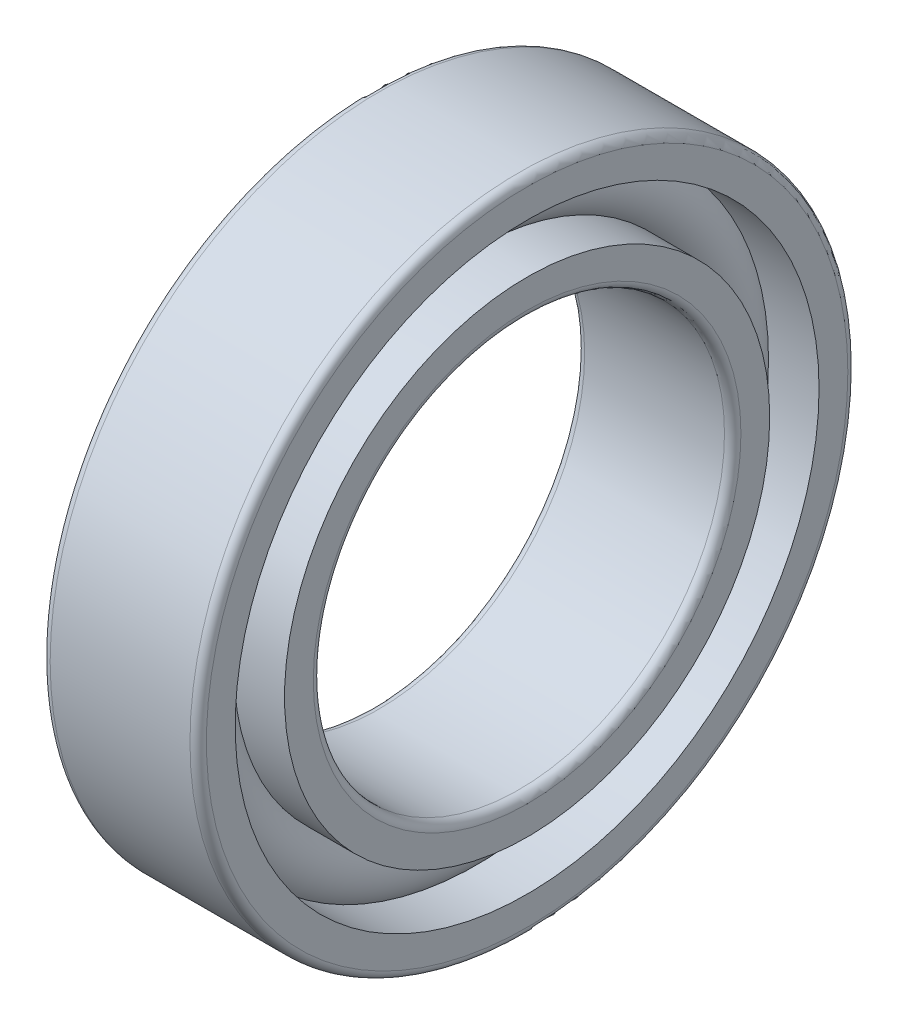
ISO-10303-21;
HEADER;
FILE_DESCRIPTION(('STEP AP214'),'2;1');
FILE_NAME('part.step','',(''),(''),'','','');
FILE_SCHEMA(('AUTOMOTIVE_DESIGN { 1 0 10303 214 1 1 1 1 }'));
ENDSEC;
DATA;
#1=APPLICATION_CONTEXT('core data for automotive mechanical design processes');
#2=APPLICATION_PROTOCOL_DEFINITION('international standard','automotive_design',2000,#1);
#3=PRODUCT_CONTEXT('',#1,'mechanical');
#4=PRODUCT('Part','Part','',(#3));
#5=PRODUCT_RELATED_PRODUCT_CATEGORY('part','',(#4));
#6=PRODUCT_DEFINITION_FORMATION('','',#4);
#7=PRODUCT_DEFINITION_CONTEXT('part definition',#1,'design');
#8=PRODUCT_DEFINITION('design','',#6,#7);
#9=PRODUCT_DEFINITION_SHAPE('','',#8);
#10=(LENGTH_UNIT() NAMED_UNIT(*) SI_UNIT(.MILLI.,.METRE.));
#11=(NAMED_UNIT(*) PLANE_ANGLE_UNIT() SI_UNIT($,.RADIAN.));
#12=(NAMED_UNIT(*) SI_UNIT($,.STERADIAN.) SOLID_ANGLE_UNIT());
#13=UNCERTAINTY_MEASURE_WITH_UNIT(LENGTH_MEASURE(1.E-05),#10,'distance_accuracy_value','');
#14=(GEOMETRIC_REPRESENTATION_CONTEXT(3) GLOBAL_UNCERTAINTY_ASSIGNED_CONTEXT((#13)) GLOBAL_UNIT_ASSIGNED_CONTEXT((#10,
#11,#12)) REPRESENTATION_CONTEXT('',''));
#15=CARTESIAN_POINT('',(0.,0.,0.));
#16=DIRECTION('',(0.,0.,1.));
#17=DIRECTION('',(1.,0.,0.));
#18=AXIS2_PLACEMENT_3D('',#15,#16,#17);
#19=CARTESIAN_POINT('',(0.,0.,0.));
#20=DIRECTION('',(-1.,0.,0.));
#21=DIRECTION('',(0.,0.,1.));
#22=AXIS2_PLACEMENT_3D('',#19,#20,#21);
#23=TOROIDAL_SURFACE('',#22,32.5,4.5);
#24=CARTESIAN_POINT('',(3.35410196624968,0.,0.));
#25=DIRECTION('',(-1.,0.,0.));
#26=DIRECTION('',(0.,0.,1.));
#27=AXIS2_PLACEMENT_3D('',#24,#25,#26);
#28=CIRCLE('',#27,35.5);
#29=CARTESIAN_POINT('',(3.35410196624968,0.,35.5));
#30=VERTEX_POINT('',#29);
#31=EDGE_CURVE('E37',#30,#30,#28,.F.);
#32=ORIENTED_EDGE('',*,*,#31,.T.);
#33=EDGE_LOOP('',(#32));
#34=FACE_BOUND('',#33,.T.);
#35=CARTESIAN_POINT('',(3.35410196624967,0.,0.));
#36=DIRECTION('',(-1.,0.,0.));
#37=DIRECTION('',(0.,0.,1.));
#38=AXIS2_PLACEMENT_3D('',#35,#36,#37);
#39=CIRCLE('',#38,29.5);
#40=CARTESIAN_POINT('',(3.35410196624967,0.,29.5));
#41=VERTEX_POINT('',#40);
#42=EDGE_CURVE('E10',#41,#41,#39,.T.);
#43=ORIENTED_EDGE('',*,*,#42,.T.);
#44=EDGE_LOOP('',(#43));
#45=FACE_BOUND('',#44,.T.);
#46=ADVANCED_FACE('F33',(#34,#45),#23,.T.);
#47=CARTESIAN_POINT('',(-20.6375,0.,0.));
#48=DIRECTION('',(1.,0.,0.));
#49=DIRECTION('',(0.,0.,-1.));
#50=AXIS2_PLACEMENT_3D('',#47,#48,#49);
#51=CYLINDRICAL_SURFACE('',#50,29.5);
#52=CARTESIAN_POINT('',(9.5,0.,0.));
#53=DIRECTION('',(1.,0.,0.));
#54=DIRECTION('',(0.,0.,-1.));
#55=AXIS2_PLACEMENT_3D('',#52,#53,#54);
#56=CIRCLE('',#55,29.5);
#57=CARTESIAN_POINT('',(9.5,0.,-29.5));
#58=VERTEX_POINT('',#57);
#59=EDGE_CURVE('E46',#58,#58,#56,.T.);
#60=ORIENTED_EDGE('',*,*,#59,.F.);
#61=EDGE_LOOP('',(#60));
#62=FACE_BOUND('',#61,.T.);
#63=ORIENTED_EDGE('',*,*,#42,.F.);
#64=EDGE_LOOP('',(#63));
#65=FACE_BOUND('',#64,.T.);
#66=ADVANCED_FACE('F85',(#62,#65),#51,.T.);
#67=CARTESIAN_POINT('',(-20.6375,0.,0.));
#68=DIRECTION('',(1.,0.,0.));
#69=DIRECTION('',(0.,0.,-1.));
#70=AXIS2_PLACEMENT_3D('',#67,#68,#69);
#71=CYLINDRICAL_SURFACE('',#70,29.5);
#72=CARTESIAN_POINT('',(-9.5,0.,0.));
#73=DIRECTION('',(1.,0.,0.));
#74=DIRECTION('',(0.,0.,-1.));
#75=AXIS2_PLACEMENT_3D('',#72,#73,#74);
#76=CIRCLE('',#75,29.5);
#77=CARTESIAN_POINT('',(-9.5,0.,-29.5));
#78=VERTEX_POINT('',#77);
#79=EDGE_CURVE('E55',#78,#78,#76,.T.);
#80=ORIENTED_EDGE('',*,*,#79,.T.);
#81=EDGE_LOOP('',(#80));
#82=FACE_BOUND('',#81,.T.);
#83=CARTESIAN_POINT('',(-3.35410196624967,0.,0.));
#84=DIRECTION('',(1.,0.,0.));
#85=DIRECTION('',(0.,0.,-1.));
#86=AXIS2_PLACEMENT_3D('',#83,#84,#85);
#87=CIRCLE('',#86,29.5);
#88=CARTESIAN_POINT('',(-3.35410196624967,0.,-29.5));
#89=VERTEX_POINT('',#88);
#90=EDGE_CURVE('E41',#89,#89,#87,.T.);
#91=ORIENTED_EDGE('',*,*,#90,.F.);
#92=EDGE_LOOP('',(#91));
#93=FACE_BOUND('',#92,.T.);
#94=ADVANCED_FACE('F88',(#82,#93),#71,.T.);
#95=CARTESIAN_POINT('',(9.5,26.,0.));
#96=DIRECTION('',(1.,0.,0.));
#97=DIRECTION('',(0.,0.,-1.));
#98=AXIS2_PLACEMENT_3D('',#95,#96,#97);
#99=PLANE('',#98);
#100=ORIENTED_EDGE('',*,*,#59,.T.);
#101=EDGE_LOOP('',(#100));
#102=FACE_BOUND('',#101,.T.);
#103=CARTESIAN_POINT('',(9.5,0.,0.));
#104=DIRECTION('',(1.,0.,0.));
#105=DIRECTION('',(0.,0.,-1.));
#106=AXIS2_PLACEMENT_3D('',#103,#104,#105);
#107=CIRCLE('',#106,26.);
#108=CARTESIAN_POINT('',(9.5,0.,-26.));
#109=VERTEX_POINT('',#108);
#110=EDGE_CURVE('E77',#109,#109,#107,.T.);
#111=ORIENTED_EDGE('',*,*,#110,.F.);
#112=EDGE_LOOP('',(#111));
#113=FACE_BOUND('',#112,.T.);
#114=ADVANCED_FACE('F82',(#102,#113),#99,.T.);
#115=CARTESIAN_POINT('',(8.5,0.,0.));
#116=DIRECTION('',(1.,0.,0.));
#117=DIRECTION('',(0.,0.,-1.));
#118=AXIS2_PLACEMENT_3D('',#115,#116,#117);
#119=TOROIDAL_SURFACE('',#118,26.,0.999999999999999);
#120=ORIENTED_EDGE('',*,*,#110,.T.);
#121=EDGE_LOOP('',(#120));
#122=FACE_BOUND('',#121,.T.);
#123=CARTESIAN_POINT('',(8.5,0.,0.));
#124=DIRECTION('',(1.,0.,0.));
#125=DIRECTION('',(0.,0.,-1.));
#126=AXIS2_PLACEMENT_3D('',#123,#124,#125);
#127=CIRCLE('',#126,25.);
#128=CARTESIAN_POINT('',(8.5,0.,-25.));
#129=VERTEX_POINT('',#128);
#130=EDGE_CURVE('E74',#129,#129,#127,.T.);
#131=ORIENTED_EDGE('',*,*,#130,.F.);
#132=EDGE_LOOP('',(#131));
#133=FACE_BOUND('',#132,.T.);
#134=ADVANCED_FACE('F99',(#122,#133),#119,.T.);
#135=CARTESIAN_POINT('',(-20.6375,0.,0.));
#136=DIRECTION('',(1.,0.,0.));
#137=DIRECTION('',(0.,0.,-1.));
#138=AXIS2_PLACEMENT_3D('',#135,#136,#137);
#139=CYLINDRICAL_SURFACE('',#138,25.);
#140=ORIENTED_EDGE('',*,*,#130,.T.);
#141=EDGE_LOOP('',(#140));
#142=FACE_BOUND('',#141,.T.);
#143=CARTESIAN_POINT('',(-8.5,0.,0.));
#144=DIRECTION('',(1.,0.,0.));
#145=DIRECTION('',(0.,0.,-1.));
#146=AXIS2_PLACEMENT_3D('',#143,#144,#145);
#147=CIRCLE('',#146,25.);
#148=CARTESIAN_POINT('',(-8.5,0.,-25.));
#149=VERTEX_POINT('',#148);
#150=EDGE_CURVE('E71',#149,#149,#147,.T.);
#151=ORIENTED_EDGE('',*,*,#150,.F.);
#152=EDGE_LOOP('',(#151));
#153=FACE_BOUND('',#152,.T.);
#154=ADVANCED_FACE('F102',(#142,#153),#139,.F.);
#155=CARTESIAN_POINT('',(-8.5,0.,0.));
#156=DIRECTION('',(1.,0.,0.));
#157=DIRECTION('',(0.,0.,-1.));
#158=AXIS2_PLACEMENT_3D('',#155,#156,#157);
#159=TOROIDAL_SURFACE('',#158,26.,0.999999999999999);
#160=ORIENTED_EDGE('',*,*,#150,.T.);
#161=EDGE_LOOP('',(#160));
#162=FACE_BOUND('',#161,.T.);
#163=CARTESIAN_POINT('',(-9.5,0.,0.));
#164=DIRECTION('',(1.,0.,0.));
#165=DIRECTION('',(0.,0.,-1.));
#166=AXIS2_PLACEMENT_3D('',#163,#164,#165);
#167=CIRCLE('',#166,26.);
#168=CARTESIAN_POINT('',(-9.5,0.,-26.));
#169=VERTEX_POINT('',#168);
#170=EDGE_CURVE('E68',#169,#169,#167,.T.);
#171=ORIENTED_EDGE('',*,*,#170,.F.);
#172=EDGE_LOOP('',(#171));
#173=FACE_BOUND('',#172,.T.);
#174=ADVANCED_FACE('F106',(#162,#173),#159,.T.);
#175=CARTESIAN_POINT('',(-9.5,29.5,0.));
#176=DIRECTION('',(-1.,0.,0.));
#177=DIRECTION('',(0.,0.,1.));
#178=AXIS2_PLACEMENT_3D('',#175,#176,#177);
#179=PLANE('',#178);
#180=ORIENTED_EDGE('',*,*,#170,.T.);
#181=EDGE_LOOP('',(#180));
#182=FACE_BOUND('',#181,.T.);
#183=ORIENTED_EDGE('',*,*,#79,.F.);
#184=EDGE_LOOP('',(#183));
#185=FACE_BOUND('',#184,.T.);
#186=ADVANCED_FACE('F110',(#182,#185),#179,.T.);
#187=CARTESIAN_POINT('',(-3.35410196624968,0.,0.));
#188=DIRECTION('',(1.,0.,0.));
#189=DIRECTION('',(0.,0.,-1.));
#190=AXIS2_PLACEMENT_3D('',#187,#188,#189);
#191=CIRCLE('',#190,35.5);
#192=CARTESIAN_POINT('',(-3.35410196624968,0.,-35.5));
#193=VERTEX_POINT('',#192);
#194=EDGE_CURVE('E49',#193,#193,#191,.F.);
#195=ORIENTED_EDGE('',*,*,#194,.T.);
#196=EDGE_LOOP('',(#195));
#197=FACE_BOUND('',#196,.T.);
#198=ORIENTED_EDGE('',*,*,#90,.T.);
#199=EDGE_LOOP('',(#198));
#200=FACE_BOUND('',#199,.T.);
#201=ADVANCED_FACE('F35',(#197,#200),#23,.T.);
#202=CARTESIAN_POINT('',(-20.6375,0.,0.));
#203=DIRECTION('',(1.,0.,0.));
#204=DIRECTION('',(0.,0.,-1.));
#205=AXIS2_PLACEMENT_3D('',#202,#203,#204);
#206=CYLINDRICAL_SURFACE('',#205,35.5);
#207=CARTESIAN_POINT('',(9.5,0.,0.));
#208=DIRECTION('',(1.,0.,0.));
#209=DIRECTION('',(0.,0.,-1.));
#210=AXIS2_PLACEMENT_3D('',#207,#208,#209);
#211=CIRCLE('',#210,35.5);
#212=CARTESIAN_POINT('',(9.5,0.,-35.5));
#213=VERTEX_POINT('',#212);
#214=EDGE_CURVE('E51',#213,#213,#211,.T.);
#215=ORIENTED_EDGE('',*,*,#214,.T.);
#216=EDGE_LOOP('',(#215));
#217=FACE_BOUND('',#216,.T.);
#218=ORIENTED_EDGE('',*,*,#31,.F.);
#219=EDGE_LOOP('',(#218));
#220=FACE_BOUND('',#219,.T.);
#221=ADVANCED_FACE('F115',(#217,#220),#206,.F.);
#222=CARTESIAN_POINT('',(-20.6375,0.,0.));
#223=DIRECTION('',(1.,0.,0.));
#224=DIRECTION('',(0.,0.,-1.));
#225=AXIS2_PLACEMENT_3D('',#222,#223,#224);
#226=CYLINDRICAL_SURFACE('',#225,35.5);
#227=CARTESIAN_POINT('',(-9.5,0.,0.));
#228=DIRECTION('',(1.,0.,0.));
#229=DIRECTION('',(0.,0.,-1.));
#230=AXIS2_PLACEMENT_3D('',#227,#228,#229);
#231=CIRCLE('',#230,35.5);
#232=CARTESIAN_POINT('',(-9.5,0.,-35.5));
#233=VERTEX_POINT('',#232);
#234=EDGE_CURVE('E146',#233,#233,#231,.T.);
#235=ORIENTED_EDGE('',*,*,#234,.F.);
#236=EDGE_LOOP('',(#235));
#237=FACE_BOUND('',#236,.T.);
#238=ORIENTED_EDGE('',*,*,#194,.F.);
#239=EDGE_LOOP('',(#238));
#240=FACE_BOUND('',#239,.T.);
#241=ADVANCED_FACE('F118',(#237,#240),#226,.F.);
#242=CARTESIAN_POINT('',(9.5,39.,0.));
#243=DIRECTION('',(1.,0.,0.));
#244=DIRECTION('',(0.,0.,-1.));
#245=AXIS2_PLACEMENT_3D('',#242,#243,#244);
#246=PLANE('',#245);
#247=CARTESIAN_POINT('',(9.5,0.,0.));
#248=DIRECTION('',(1.,0.,0.));
#249=DIRECTION('',(0.,0.,-1.));
#250=AXIS2_PLACEMENT_3D('',#247,#248,#249);
#251=CIRCLE('',#250,39.);
#252=CARTESIAN_POINT('',(9.5,0.,-39.));
#253=VERTEX_POINT('',#252);
#254=EDGE_CURVE('E57',#253,#253,#251,.T.);
#255=ORIENTED_EDGE('',*,*,#254,.T.);
#256=EDGE_LOOP('',(#255));
#257=FACE_BOUND('',#256,.T.);
#258=ORIENTED_EDGE('',*,*,#214,.F.);
#259=EDGE_LOOP('',(#258));
#260=FACE_BOUND('',#259,.T.);
#261=ADVANCED_FACE('F119',(#257,#260),#246,.T.);
#262=CARTESIAN_POINT('',(8.5,0.,0.));
#263=DIRECTION('',(1.,0.,0.));
#264=DIRECTION('',(0.,0.,-1.));
#265=AXIS2_PLACEMENT_3D('',#262,#263,#264);
#266=TOROIDAL_SURFACE('',#265,39.,1.);
#267=CARTESIAN_POINT('',(8.5,0.,0.));
#268=DIRECTION('',(1.,0.,0.));
#269=DIRECTION('',(0.,0.,-1.));
#270=AXIS2_PLACEMENT_3D('',#267,#268,#269);
#271=CIRCLE('',#270,40.);
#272=CARTESIAN_POINT('',(8.5,0.,-40.));
#273=VERTEX_POINT('',#272);
#274=EDGE_CURVE('E62',#273,#273,#271,.T.);
#275=ORIENTED_EDGE('',*,*,#274,.T.);
#276=EDGE_LOOP('',(#275));
#277=FACE_BOUND('',#276,.T.);
#278=ORIENTED_EDGE('',*,*,#254,.F.);
#279=EDGE_LOOP('',(#278));
#280=FACE_BOUND('',#279,.T.);
#281=ADVANCED_FACE('F122',(#277,#280),#266,.T.);
#282=CARTESIAN_POINT('',(-20.6375,0.,0.));
#283=DIRECTION('',(1.,0.,0.));
#284=DIRECTION('',(0.,0.,-1.));
#285=AXIS2_PLACEMENT_3D('',#282,#283,#284);
#286=CYLINDRICAL_SURFACE('',#285,40.);
#287=CARTESIAN_POINT('',(-8.5,0.,0.));
#288=DIRECTION('',(1.,0.,0.));
#289=DIRECTION('',(0.,0.,-1.));
#290=AXIS2_PLACEMENT_3D('',#287,#288,#289);
#291=CIRCLE('',#290,40.);
#292=CARTESIAN_POINT('',(-8.5,0.,-40.));
#293=VERTEX_POINT('',#292);
#294=EDGE_CURVE('E150',#293,#293,#291,.T.);
#295=ORIENTED_EDGE('',*,*,#294,.T.);
#296=EDGE_LOOP('',(#295));
#297=FACE_BOUND('',#296,.T.);
#298=ORIENTED_EDGE('',*,*,#274,.F.);
#299=EDGE_LOOP('',(#298));
#300=FACE_BOUND('',#299,.T.);
#301=ADVANCED_FACE('F126',(#297,#300),#286,.T.);
#302=CARTESIAN_POINT('',(-8.5,0.,0.));
#303=DIRECTION('',(1.,0.,0.));
#304=DIRECTION('',(0.,0.,-1.));
#305=AXIS2_PLACEMENT_3D('',#302,#303,#304);
#306=TOROIDAL_SURFACE('',#305,39.,1.);
#307=CARTESIAN_POINT('',(-9.5,0.,0.));
#308=DIRECTION('',(1.,0.,0.));
#309=DIRECTION('',(0.,0.,-1.));
#310=AXIS2_PLACEMENT_3D('',#307,#308,#309);
#311=CIRCLE('',#310,39.);
#312=CARTESIAN_POINT('',(-9.5,0.,-39.));
#313=VERTEX_POINT('',#312);
#314=EDGE_CURVE('E147',#313,#313,#311,.T.);
#315=ORIENTED_EDGE('',*,*,#314,.T.);
#316=EDGE_LOOP('',(#315));
#317=FACE_BOUND('',#316,.T.);
#318=ORIENTED_EDGE('',*,*,#294,.F.);
#319=EDGE_LOOP('',(#318));
#320=FACE_BOUND('',#319,.T.);
#321=ADVANCED_FACE('F130',(#317,#320),#306,.T.);
#322=CARTESIAN_POINT('',(-9.5,35.5,0.));
#323=DIRECTION('',(-1.,0.,0.));
#324=DIRECTION('',(0.,0.,1.));
#325=AXIS2_PLACEMENT_3D('',#322,#323,#324);
#326=PLANE('',#325);
#327=ORIENTED_EDGE('',*,*,#234,.T.);
#328=EDGE_LOOP('',(#327));
#329=FACE_BOUND('',#328,.T.);
#330=ORIENTED_EDGE('',*,*,#314,.F.);
#331=EDGE_LOOP('',(#330));
#332=FACE_BOUND('',#331,.T.);
#333=ADVANCED_FACE('F134',(#329,#332),#326,.T.);
#334=CLOSED_SHELL('',(#46,#66,#94,#114,#134,#154,#174,#186,#201,#221,#241,#261,#281,#301,#321,#333));
#335=MANIFOLD_SOLID_BREP('B2',#334);
#336=ADVANCED_BREP_SHAPE_REPRESENTATION('',(#18,#335),#14);
#337=SHAPE_DEFINITION_REPRESENTATION(#9,#336);
ENDSEC;
END-ISO-10303-21;
